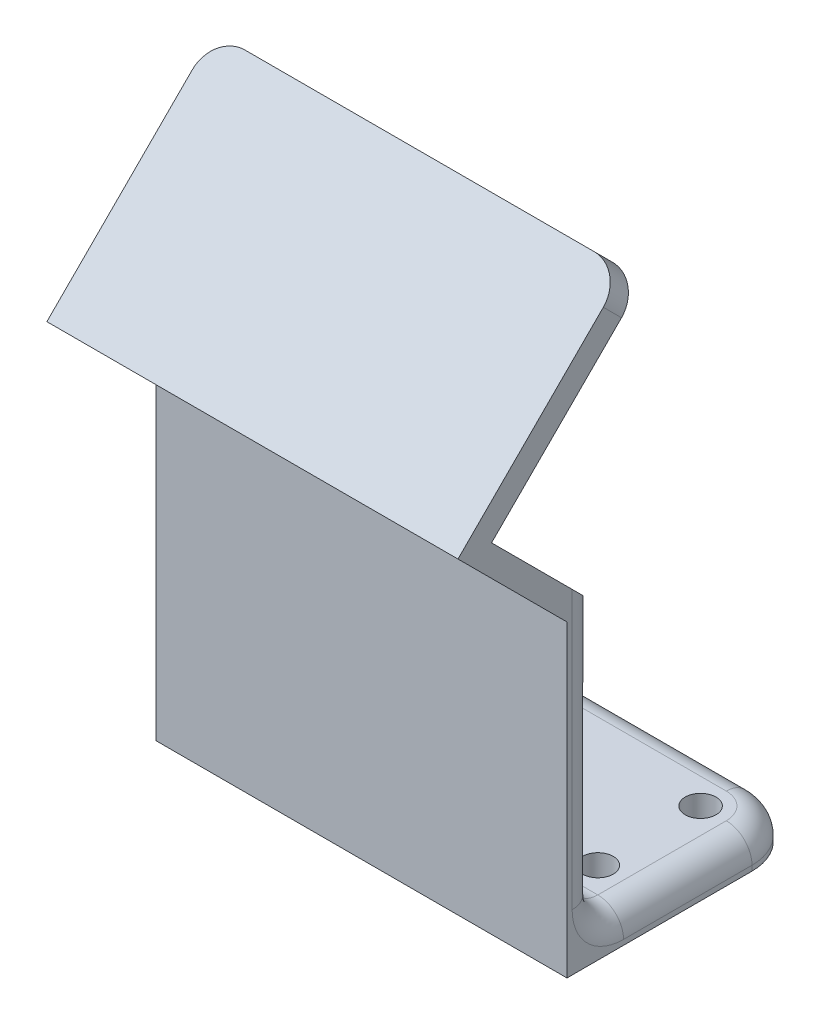
ISO-10303-21;
HEADER;
FILE_DESCRIPTION(('STEP AP214'),'2;1');
FILE_NAME('part.step','',(''),(''),'','','');
FILE_SCHEMA(('AUTOMOTIVE_DESIGN { 1 0 10303 214 1 1 1 1 }'));
ENDSEC;
DATA;
#1=APPLICATION_CONTEXT('core data for automotive mechanical design processes');
#2=APPLICATION_PROTOCOL_DEFINITION('international standard','automotive_design',2000,#1);
#3=PRODUCT_CONTEXT('',#1,'mechanical');
#4=PRODUCT('Part','Part','',(#3));
#5=PRODUCT_RELATED_PRODUCT_CATEGORY('part','',(#4));
#6=PRODUCT_DEFINITION_FORMATION('','',#4);
#7=PRODUCT_DEFINITION_CONTEXT('part definition',#1,'design');
#8=PRODUCT_DEFINITION('design','',#6,#7);
#9=PRODUCT_DEFINITION_SHAPE('','',#8);
#10=(LENGTH_UNIT() NAMED_UNIT(*) SI_UNIT(.MILLI.,.METRE.));
#11=(NAMED_UNIT(*) PLANE_ANGLE_UNIT() SI_UNIT($,.RADIAN.));
#12=(NAMED_UNIT(*) SI_UNIT($,.STERADIAN.) SOLID_ANGLE_UNIT());
#13=UNCERTAINTY_MEASURE_WITH_UNIT(LENGTH_MEASURE(1.E-05),#10,'distance_accuracy_value','');
#14=(GEOMETRIC_REPRESENTATION_CONTEXT(3) GLOBAL_UNCERTAINTY_ASSIGNED_CONTEXT((#13)) GLOBAL_UNIT_ASSIGNED_CONTEXT((#10,
#11,#12)) REPRESENTATION_CONTEXT('',''));
#15=CARTESIAN_POINT('',(0.,0.,0.));
#16=DIRECTION('',(0.,0.,1.));
#17=DIRECTION('',(1.,0.,0.));
#18=AXIS2_PLACEMENT_3D('',#15,#16,#17);
#19=CARTESIAN_POINT('',(-32.3593108702889,40.6066017177982,13.6066017177982));
#20=DIRECTION('',(0.,0.707106781186545,0.707106781186549));
#21=DIRECTION('',(0.,-0.70710678118655,0.707106781186546));
#22=AXIS2_PLACEMENT_3D('',#19,#20,#21);
#23=PLANE('',#22);
#24=CARTESIAN_POINT('',(3.,54.7487373415292,-0.53553390593266));
#25=DIRECTION('',(0.,0.707106781186546,0.707106781186549));
#26=DIRECTION('',(0.,-0.707106781186549,0.707106781186546));
#27=AXIS2_PLACEMENT_3D('',#24,#25,#26);
#28=CIRCLE('',#27,3.);
#29=CARTESIAN_POINT('',(0.,54.7487373415292,-0.53553390593265));
#30=VERTEX_POINT('',#29);
#31=CARTESIAN_POINT('',(3.00000000000002,56.8700576850888,-2.65685424949229));
#32=VERTEX_POINT('',#31);
#33=EDGE_CURVE('E183',#30,#32,#28,.F.);
#34=ORIENTED_EDGE('',*,*,#33,.F.);
#35=DIRECTION('',(0.,0.70710678118655,-0.707106781186546));
#36=VECTOR('',#35,1.);
#37=CARTESIAN_POINT('',(0.,40.6066017177982,13.6066017177982));
#38=LINE('',#37,#36);
#39=CARTESIAN_POINT('',(0.,40.6066017177982,13.6066017177982));
#40=VERTEX_POINT('',#39);
#41=EDGE_CURVE('E196',#40,#30,#38,.T.);
#42=ORIENTED_EDGE('',*,*,#41,.F.);
#43=DIRECTION('',(1.,0.,0.));
#44=VECTOR('',#43,1.);
#45=CARTESIAN_POINT('',(-32.3593108702889,40.6066017177982,13.6066017177982));
#46=LINE('',#45,#44);
#47=CARTESIAN_POINT('',(40.,40.6066017177982,13.6066017177982));
#48=VERTEX_POINT('',#47);
#49=EDGE_CURVE('E211',#40,#48,#46,.T.);
#50=ORIENTED_EDGE('',*,*,#49,.T.);
#51=DIRECTION('',(0.,-0.707106781186549,0.707106781186545));
#52=VECTOR('',#51,1.);
#53=CARTESIAN_POINT('',(40.,40.6066017177982,13.6066017177982));
#54=LINE('',#53,#52);
#55=CARTESIAN_POINT('',(40.,54.7487373415292,-0.535533905932639));
#56=VERTEX_POINT('',#55);
#57=EDGE_CURVE('E220',#56,#48,#54,.T.);
#58=ORIENTED_EDGE('',*,*,#57,.F.);
#59=CARTESIAN_POINT('',(37.,54.7487373415292,-0.535533905932653));
#60=DIRECTION('',(0.,0.707106781186546,0.707106781186549));
#61=DIRECTION('',(0.,-0.707106781186549,0.707106781186546));
#62=AXIS2_PLACEMENT_3D('',#59,#60,#61);
#63=CIRCLE('',#62,3.);
#64=CARTESIAN_POINT('',(37.,56.8700576850888,-2.65685424949229));
#65=VERTEX_POINT('',#64);
#66=EDGE_CURVE('E371',#56,#65,#63,.T.);
#67=ORIENTED_EDGE('',*,*,#66,.T.);
#68=DIRECTION('',(1.,0.,0.));
#69=VECTOR('',#68,1.);
#70=CARTESIAN_POINT('',(-32.3593108702889,56.8700576850888,-2.65685424949229));
#71=LINE('',#70,#69);
#72=EDGE_CURVE('E200',#32,#65,#71,.T.);
#73=ORIENTED_EDGE('',*,*,#72,.F.);
#74=EDGE_LOOP('',(#34,#42,#50,#58,#67,#73));
#75=FACE_BOUND('',#74,.T.);
#76=ADVANCED_FACE('F39',(#75),#23,.T.);
#77=CARTESIAN_POINT('',(-32.3593108702889,55.1022907321225,-4.42462120245867));
#78=DIRECTION('',(0.,-0.707106781186545,-0.70710678118655));
#79=DIRECTION('',(0.,0.70710678118655,-0.707106781186545));
#80=AXIS2_PLACEMENT_3D('',#77,#78,#79);
#81=PLANE('',#80);
#82=CARTESIAN_POINT('',(3.,52.9809703885628,-2.30330085889904));
#83=DIRECTION('',(0.,-0.707106781186545,-0.70710678118655));
#84=DIRECTION('',(0.,0.70710678118655,-0.707106781186545));
#85=AXIS2_PLACEMENT_3D('',#82,#83,#84);
#86=CIRCLE('',#85,3.);
#87=CARTESIAN_POINT('',(3.,55.1022907321225,-4.42462120245867));
#88=VERTEX_POINT('',#87);
#89=CARTESIAN_POINT('',(0.,52.9809703885628,-2.30330085889902));
#90=VERTEX_POINT('',#89);
#91=EDGE_CURVE('E186',#88,#90,#86,.F.);
#92=ORIENTED_EDGE('',*,*,#91,.F.);
#93=DIRECTION('',(1.,0.,0.));
#94=VECTOR('',#93,1.);
#95=CARTESIAN_POINT('',(-32.3593108702889,55.1022907321225,-4.42462120245867));
#96=LINE('',#95,#94);
#97=CARTESIAN_POINT('',(37.,55.1022907321225,-4.42462120245867));
#98=VERTEX_POINT('',#97);
#99=EDGE_CURVE('E228',#88,#98,#96,.T.);
#100=ORIENTED_EDGE('',*,*,#99,.T.);
#101=CARTESIAN_POINT('',(37.,52.9809703885628,-2.30330085889903));
#102=DIRECTION('',(0.,-0.707106781186545,-0.70710678118655));
#103=DIRECTION('',(0.,0.70710678118655,-0.707106781186545));
#104=AXIS2_PLACEMENT_3D('',#101,#102,#103);
#105=CIRCLE('',#104,3.);
#106=CARTESIAN_POINT('',(40.,52.9809703885628,-2.30330085889902));
#107=VERTEX_POINT('',#106);
#108=EDGE_CURVE('E291',#98,#107,#105,.T.);
#109=ORIENTED_EDGE('',*,*,#108,.T.);
#110=DIRECTION('',(0.,0.70710678118655,-0.707106781186545));
#111=VECTOR('',#110,1.);
#112=CARTESIAN_POINT('',(40.,55.1022907321225,-4.42462120245867));
#113=LINE('',#112,#111);
#114=CARTESIAN_POINT('',(40.,40.3388347648318,10.3388347648319));
#115=VERTEX_POINT('',#114);
#116=EDGE_CURVE('E217',#115,#107,#113,.T.);
#117=ORIENTED_EDGE('',*,*,#116,.F.);
#118=DIRECTION('',(1.,0.,0.));
#119=VECTOR('',#118,1.);
#120=CARTESIAN_POINT('',(-32.3593108702889,40.3388347648318,10.3388347648319));
#121=LINE('',#120,#119);
#122=CARTESIAN_POINT('',(0.,40.3388347648318,10.3388347648319));
#123=VERTEX_POINT('',#122);
#124=EDGE_CURVE('E225',#123,#115,#121,.T.);
#125=ORIENTED_EDGE('',*,*,#124,.F.);
#126=DIRECTION('',(0.,-0.70710678118655,0.707106781186545));
#127=VECTOR('',#126,1.);
#128=CARTESIAN_POINT('',(0.,55.1022907321225,-4.42462120245867));
#129=LINE('',#128,#127);
#130=EDGE_CURVE('E207',#90,#123,#129,.T.);
#131=ORIENTED_EDGE('',*,*,#130,.F.);
#132=EDGE_LOOP('',(#92,#100,#109,#117,#125,#131));
#133=FACE_BOUND('',#132,.T.);
#134=ADVANCED_FACE('F388',(#133),#81,.T.);
#135=CARTESIAN_POINT('',(5.,3.,-15.));
#136=DIRECTION('',(0.,-1.,0.));
#137=DIRECTION('',(0.,0.,-1.));
#138=AXIS2_PLACEMENT_3D('',#135,#136,#137);
#139=PLANE('',#138);
#140=CARTESIAN_POINT('',(35.,3.,-15.));
#141=DIRECTION('',(0.,-1.,0.));
#142=DIRECTION('',(0.,0.,-1.));
#143=AXIS2_PLACEMENT_3D('',#140,#141,#142);
#144=CIRCLE('',#143,2.5);
#145=CARTESIAN_POINT('',(37.5,3.,-15.));
#146=VERTEX_POINT('',#145);
#147=CARTESIAN_POINT('',(35.,3.,-17.5));
#148=VERTEX_POINT('',#147);
#149=EDGE_CURVE('E303',#146,#148,#144,.F.);
#150=ORIENTED_EDGE('',*,*,#149,.T.);
#151=DIRECTION('',(-1.,0.,0.));
#152=VECTOR('',#151,1.);
#153=CARTESIAN_POINT('',(5.,3.,-17.5));
#154=LINE('',#153,#152);
#155=CARTESIAN_POINT('',(5.00000000000004,3.,-17.5));
#156=VERTEX_POINT('',#155);
#157=EDGE_CURVE('E305',#148,#156,#154,.T.);
#158=ORIENTED_EDGE('',*,*,#157,.T.);
#159=CARTESIAN_POINT('',(5.,3.,-15.));
#160=DIRECTION('',(0.,-1.,0.));
#161=DIRECTION('',(0.,0.,-1.));
#162=AXIS2_PLACEMENT_3D('',#159,#160,#161);
#163=CIRCLE('',#162,2.5);
#164=CARTESIAN_POINT('',(2.5,3.,-15.));
#165=VERTEX_POINT('',#164);
#166=EDGE_CURVE('E301',#156,#165,#163,.F.);
#167=ORIENTED_EDGE('',*,*,#166,.T.);
#168=DIRECTION('',(0.,0.,1.));
#169=VECTOR('',#168,1.);
#170=CARTESIAN_POINT('',(2.5,3.,-15.));
#171=LINE('',#170,#169);
#172=CARTESIAN_POINT('',(2.5,3.,-2.5));
#173=VERTEX_POINT('',#172);
#174=EDGE_CURVE('E297',#165,#173,#171,.T.);
#175=ORIENTED_EDGE('',*,*,#174,.T.);
#176=DIRECTION('',(1.,0.,0.));
#177=VECTOR('',#176,1.);
#178=CARTESIAN_POINT('',(5.,3.,-2.5));
#179=LINE('',#178,#177);
#180=CARTESIAN_POINT('',(37.5,3.,-2.5));
#181=VERTEX_POINT('',#180);
#182=EDGE_CURVE('E295',#173,#181,#179,.T.);
#183=ORIENTED_EDGE('',*,*,#182,.T.);
#184=DIRECTION('',(0.,0.,-1.));
#185=VECTOR('',#184,1.);
#186=CARTESIAN_POINT('',(37.5,3.,-15.));
#187=LINE('',#186,#185);
#188=EDGE_CURVE('E299',#181,#146,#187,.T.);
#189=ORIENTED_EDGE('',*,*,#188,.T.);
#190=EDGE_LOOP('',(#150,#158,#167,#175,#183,#189));
#191=FACE_BOUND('',#190,.T.);
#192=CARTESIAN_POINT('',(5.,3.,-15.));
#193=DIRECTION('',(0.,1.,0.));
#194=DIRECTION('',(0.,0.,1.));
#195=AXIS2_PLACEMENT_3D('',#192,#193,#194);
#196=CIRCLE('',#195,1.5);
#197=CARTESIAN_POINT('',(5.,3.,-13.5));
#198=VERTEX_POINT('',#197);
#199=EDGE_CURVE('E264',#198,#198,#196,.T.);
#200=ORIENTED_EDGE('',*,*,#199,.F.);
#201=EDGE_LOOP('',(#200));
#202=FACE_BOUND('',#201,.T.);
#203=CARTESIAN_POINT('',(5.,3.,-5.));
#204=DIRECTION('',(0.,1.,0.));
#205=DIRECTION('',(0.,0.,1.));
#206=AXIS2_PLACEMENT_3D('',#203,#204,#205);
#207=CIRCLE('',#206,1.5);
#208=CARTESIAN_POINT('',(5.,3.,-3.5));
#209=VERTEX_POINT('',#208);
#210=EDGE_CURVE('E258',#209,#209,#207,.T.);
#211=ORIENTED_EDGE('',*,*,#210,.F.);
#212=EDGE_LOOP('',(#211));
#213=FACE_BOUND('',#212,.T.);
#214=CARTESIAN_POINT('',(35.,3.,-15.));
#215=DIRECTION('',(0.,1.,0.));
#216=DIRECTION('',(0.,0.,-1.));
#217=AXIS2_PLACEMENT_3D('',#214,#215,#216);
#218=CIRCLE('',#217,1.5);
#219=CARTESIAN_POINT('',(35.,3.,-16.5));
#220=VERTEX_POINT('',#219);
#221=EDGE_CURVE('E252',#220,#220,#218,.T.);
#222=ORIENTED_EDGE('',*,*,#221,.F.);
#223=EDGE_LOOP('',(#222));
#224=FACE_BOUND('',#223,.T.);
#225=CARTESIAN_POINT('',(35.,3.,-5.));
#226=DIRECTION('',(0.,1.,0.));
#227=DIRECTION('',(0.,0.,-1.));
#228=AXIS2_PLACEMENT_3D('',#225,#226,#227);
#229=CIRCLE('',#228,1.5);
#230=CARTESIAN_POINT('',(35.,3.,-6.5));
#231=VERTEX_POINT('',#230);
#232=EDGE_CURVE('E246',#231,#231,#229,.T.);
#233=ORIENTED_EDGE('',*,*,#232,.F.);
#234=EDGE_LOOP('',(#233));
#235=FACE_BOUND('',#234,.T.);
#236=ADVANCED_FACE('F463',(#191,#202,#213,#224,#235),#139,.F.);
#237=CARTESIAN_POINT('',(5.,0.,-15.));
#238=DIRECTION('',(0.,-1.,0.));
#239=DIRECTION('',(0.,0.,-1.));
#240=AXIS2_PLACEMENT_3D('',#237,#238,#239);
#241=PLANE('',#240);
#242=CARTESIAN_POINT('',(35.,0.,-15.));
#243=DIRECTION('',(0.,1.,0.));
#244=DIRECTION('',(0.,0.,-1.));
#245=AXIS2_PLACEMENT_3D('',#242,#243,#244);
#246=CIRCLE('',#245,1.5);
#247=CARTESIAN_POINT('',(35.,0.,-16.5));
#248=VERTEX_POINT('',#247);
#249=EDGE_CURVE('E249',#248,#248,#246,.T.);
#250=ORIENTED_EDGE('',*,*,#249,.T.);
#251=EDGE_LOOP('',(#250));
#252=FACE_BOUND('',#251,.T.);
#253=CARTESIAN_POINT('',(5.,0.,-15.));
#254=DIRECTION('',(0.,1.,0.));
#255=DIRECTION('',(0.,0.,1.));
#256=AXIS2_PLACEMENT_3D('',#253,#254,#255);
#257=CIRCLE('',#256,1.5);
#258=CARTESIAN_POINT('',(5.,0.,-13.5));
#259=VERTEX_POINT('',#258);
#260=EDGE_CURVE('E261',#259,#259,#257,.T.);
#261=ORIENTED_EDGE('',*,*,#260,.T.);
#262=EDGE_LOOP('',(#261));
#263=FACE_BOUND('',#262,.T.);
#264=DIRECTION('',(0.,0.,1.));
#265=VECTOR('',#264,1.);
#266=CARTESIAN_POINT('',(0.,0.,0.));
#267=LINE('',#266,#265);
#268=CARTESIAN_POINT('',(0.,0.,-15.));
#269=VERTEX_POINT('',#268);
#270=CARTESIAN_POINT('',(0.,0.,3.));
#271=VERTEX_POINT('',#270);
#272=EDGE_CURVE('E267',#269,#271,#267,.T.);
#273=ORIENTED_EDGE('',*,*,#272,.F.);
#274=CARTESIAN_POINT('',(5.,0.,-15.));
#275=DIRECTION('',(0.,1.,0.));
#276=DIRECTION('',(0.,0.,-1.));
#277=AXIS2_PLACEMENT_3D('',#274,#275,#276);
#278=CIRCLE('',#277,5.);
#279=CARTESIAN_POINT('',(5.00000000000004,0.,-20.));
#280=VERTEX_POINT('',#279);
#281=EDGE_CURVE('E280',#280,#269,#278,.T.);
#282=ORIENTED_EDGE('',*,*,#281,.F.);
#283=DIRECTION('',(-1.,0.,0.));
#284=VECTOR('',#283,1.);
#285=CARTESIAN_POINT('',(5.00000000000004,0.,-20.));
#286=LINE('',#285,#284);
#287=CARTESIAN_POINT('',(35.,0.,-20.));
#288=VERTEX_POINT('',#287);
#289=EDGE_CURVE('E277',#288,#280,#286,.T.);
#290=ORIENTED_EDGE('',*,*,#289,.F.);
#291=CARTESIAN_POINT('',(35.,0.,-15.));
#292=DIRECTION('',(0.,1.,0.));
#293=DIRECTION('',(0.,0.,1.));
#294=AXIS2_PLACEMENT_3D('',#291,#292,#293);
#295=CIRCLE('',#294,5.);
#296=CARTESIAN_POINT('',(40.,0.,-15.));
#297=VERTEX_POINT('',#296);
#298=EDGE_CURVE('E274',#297,#288,#295,.T.);
#299=ORIENTED_EDGE('',*,*,#298,.F.);
#300=DIRECTION('',(0.,0.,-1.));
#301=VECTOR('',#300,1.);
#302=CARTESIAN_POINT('',(40.,0.,0.));
#303=LINE('',#302,#301);
#304=CARTESIAN_POINT('',(40.,0.,3.));
#305=VERTEX_POINT('',#304);
#306=EDGE_CURVE('E271',#305,#297,#303,.T.);
#307=ORIENTED_EDGE('',*,*,#306,.F.);
#308=DIRECTION('',(1.,0.,0.));
#309=VECTOR('',#308,1.);
#310=CARTESIAN_POINT('',(0.,0.,3.));
#311=LINE('',#310,#309);
#312=EDGE_CURVE('E238',#271,#305,#311,.T.);
#313=ORIENTED_EDGE('',*,*,#312,.F.);
#314=EDGE_LOOP('',(#273,#282,#290,#299,#307,#313));
#315=FACE_BOUND('',#314,.T.);
#316=CARTESIAN_POINT('',(5.,0.,-5.));
#317=DIRECTION('',(0.,1.,0.));
#318=DIRECTION('',(0.,0.,1.));
#319=AXIS2_PLACEMENT_3D('',#316,#317,#318);
#320=CIRCLE('',#319,1.5);
#321=CARTESIAN_POINT('',(5.,0.,-3.5));
#322=VERTEX_POINT('',#321);
#323=EDGE_CURVE('E255',#322,#322,#320,.T.);
#324=ORIENTED_EDGE('',*,*,#323,.T.);
#325=EDGE_LOOP('',(#324));
#326=FACE_BOUND('',#325,.T.);
#327=CARTESIAN_POINT('',(35.,0.,-5.));
#328=DIRECTION('',(0.,1.,0.));
#329=DIRECTION('',(0.,0.,-1.));
#330=AXIS2_PLACEMENT_3D('',#327,#328,#329);
#331=CIRCLE('',#330,1.5);
#332=CARTESIAN_POINT('',(35.,0.,-6.5));
#333=VERTEX_POINT('',#332);
#334=EDGE_CURVE('E245',#333,#333,#331,.T.);
#335=ORIENTED_EDGE('',*,*,#334,.T.);
#336=EDGE_LOOP('',(#335));
#337=FACE_BOUND('',#336,.T.);
#338=ADVANCED_FACE('F431',(#252,#263,#315,#326,#337),#241,.T.);
#339=CARTESIAN_POINT('',(0.,3.,0.));
#340=DIRECTION('',(1.,0.,0.));
#341=DIRECTION('',(0.,0.,-1.));
#342=AXIS2_PLACEMENT_3D('',#339,#340,#341);
#343=PLANE('',#342);
#344=CARTESIAN_POINT('',(0.,5.5,-2.5));
#345=DIRECTION('',(1.,0.,0.));
#346=DIRECTION('',(0.,0.,-1.));
#347=AXIS2_PLACEMENT_3D('',#344,#345,#346);
#348=CIRCLE('',#347,5.);
#349=CARTESIAN_POINT('',(0.,0.5,-2.5));
#350=VERTEX_POINT('',#349);
#351=CARTESIAN_POINT('',(0.,5.5,2.5));
#352=VERTEX_POINT('',#351);
#353=EDGE_CURVE('E322',#350,#352,#348,.F.);
#354=ORIENTED_EDGE('',*,*,#353,.F.);
#355=DIRECTION('',(0.,0.,1.));
#356=VECTOR('',#355,1.);
#357=CARTESIAN_POINT('',(0.,0.5,0.));
#358=LINE('',#357,#356);
#359=CARTESIAN_POINT('',(0.,0.5,-15.));
#360=VERTEX_POINT('',#359);
#361=EDGE_CURVE('E327',#350,#360,#358,.F.);
#362=ORIENTED_EDGE('',*,*,#361,.T.);
#363=DIRECTION('',(0.,-1.,0.));
#364=VECTOR('',#363,1.);
#365=CARTESIAN_POINT('',(0.,3.,-15.));
#366=LINE('',#365,#364);
#367=EDGE_CURVE('E283',#360,#269,#366,.T.);
#368=ORIENTED_EDGE('',*,*,#367,.T.);
#369=ORIENTED_EDGE('',*,*,#272,.T.);
#370=DIRECTION('',(0.,-1.,0.));
#371=VECTOR('',#370,1.);
#372=CARTESIAN_POINT('',(0.,0.,3.));
#373=LINE('',#372,#371);
#374=CARTESIAN_POINT('',(0.,30.,3.));
#375=VERTEX_POINT('',#374);
#376=EDGE_CURVE('E235',#375,#271,#373,.T.);
#377=ORIENTED_EDGE('',*,*,#376,.F.);
#378=DIRECTION('',(0.,0.707106781186545,0.70710678118655));
#379=VECTOR('',#378,1.);
#380=CARTESIAN_POINT('',(0.,30.,3.));
#381=LINE('',#380,#379);
#382=EDGE_CURVE('E206',#375,#40,#381,.T.);
#383=ORIENTED_EDGE('',*,*,#382,.T.);
#384=ORIENTED_EDGE('',*,*,#41,.T.);
#385=DIRECTION('',(0.,0.707106781186546,0.707106781186549));
#386=VECTOR('',#385,1.);
#387=CARTESIAN_POINT('',(0.,52.6274169979695,-2.6568542494923));
#388=LINE('',#387,#386);
#389=EDGE_CURVE('E180',#90,#30,#388,.T.);
#390=ORIENTED_EDGE('',*,*,#389,.F.);
#391=ORIENTED_EDGE('',*,*,#130,.T.);
#392=DIRECTION('',(0.,-0.707106781186545,-0.70710678118655));
#393=VECTOR('',#392,1.);
#394=CARTESIAN_POINT('',(0.,40.3388347648318,10.3388347648319));
#395=LINE('',#394,#393);
#396=CARTESIAN_POINT('',(0.,32.5,2.5));
#397=VERTEX_POINT('',#396);
#398=EDGE_CURVE('E209',#123,#397,#395,.T.);
#399=ORIENTED_EDGE('',*,*,#398,.T.);
#400=DIRECTION('',(0.,-1.,0.));
#401=VECTOR('',#400,1.);
#402=CARTESIAN_POINT('',(0.,3.,2.5));
#403=LINE('',#402,#401);
#404=EDGE_CURVE('E325',#397,#352,#403,.T.);
#405=ORIENTED_EDGE('',*,*,#404,.T.);
#406=EDGE_LOOP('',(#354,#362,#368,#369,#377,#383,#384,#390,#391,#399,#405));
#407=FACE_BOUND('',#406,.T.);
#408=ADVANCED_FACE('F203',(#407),#343,.F.);
#409=CARTESIAN_POINT('',(40.,3.,0.));
#410=DIRECTION('',(-1.,0.,0.));
#411=DIRECTION('',(0.,0.,1.));
#412=AXIS2_PLACEMENT_3D('',#409,#410,#411);
#413=PLANE('',#412);
#414=DIRECTION('',(0.,-1.,0.));
#415=VECTOR('',#414,1.);
#416=CARTESIAN_POINT('',(40.,3.,-15.));
#417=LINE('',#416,#415);
#418=CARTESIAN_POINT('',(40.,0.5,-15.));
#419=VERTEX_POINT('',#418);
#420=EDGE_CURVE('E289',#419,#297,#417,.T.);
#421=ORIENTED_EDGE('',*,*,#420,.F.);
#422=DIRECTION('',(0.,0.,-1.));
#423=VECTOR('',#422,1.);
#424=CARTESIAN_POINT('',(40.,0.5,0.));
#425=LINE('',#424,#423);
#426=CARTESIAN_POINT('',(40.,0.5,-2.5));
#427=VERTEX_POINT('',#426);
#428=EDGE_CURVE('E320',#419,#427,#425,.F.);
#429=ORIENTED_EDGE('',*,*,#428,.T.);
#430=CARTESIAN_POINT('',(40.,5.5,-2.5));
#431=DIRECTION('',(-1.,0.,0.));
#432=DIRECTION('',(0.,0.,1.));
#433=AXIS2_PLACEMENT_3D('',#430,#431,#432);
#434=CIRCLE('',#433,5.);
#435=CARTESIAN_POINT('',(40.,5.5,2.5));
#436=VERTEX_POINT('',#435);
#437=EDGE_CURVE('E317',#436,#427,#434,.F.);
#438=ORIENTED_EDGE('',*,*,#437,.F.);
#439=DIRECTION('',(0.,1.,0.));
#440=VECTOR('',#439,1.);
#441=CARTESIAN_POINT('',(40.,30.,2.5));
#442=LINE('',#441,#440);
#443=CARTESIAN_POINT('',(40.,32.5,2.5));
#444=VERTEX_POINT('',#443);
#445=EDGE_CURVE('E315',#436,#444,#442,.T.);
#446=ORIENTED_EDGE('',*,*,#445,.T.);
#447=DIRECTION('',(0.,0.707106781186545,0.70710678118655));
#448=VECTOR('',#447,1.);
#449=CARTESIAN_POINT('',(40.,40.3388347648318,10.3388347648319));
#450=LINE('',#449,#448);
#451=EDGE_CURVE('E215',#444,#115,#450,.T.);
#452=ORIENTED_EDGE('',*,*,#451,.T.);
#453=ORIENTED_EDGE('',*,*,#116,.T.);
#454=DIRECTION('',(0.,0.707106781186546,0.707106781186549));
#455=VECTOR('',#454,1.);
#456=CARTESIAN_POINT('',(40.,52.6274169979695,-2.65685424949229));
#457=LINE('',#456,#455);
#458=EDGE_CURVE('E375',#107,#56,#457,.T.);
#459=ORIENTED_EDGE('',*,*,#458,.T.);
#460=ORIENTED_EDGE('',*,*,#57,.T.);
#461=DIRECTION('',(0.,-0.707106781186545,-0.70710678118655));
#462=VECTOR('',#461,1.);
#463=CARTESIAN_POINT('',(40.,30.,3.));
#464=LINE('',#463,#462);
#465=CARTESIAN_POINT('',(40.,30.,3.));
#466=VERTEX_POINT('',#465);
#467=EDGE_CURVE('E222',#48,#466,#464,.T.);
#468=ORIENTED_EDGE('',*,*,#467,.T.);
#469=DIRECTION('',(0.,1.,0.));
#470=VECTOR('',#469,1.);
#471=CARTESIAN_POINT('',(40.,0.,3.));
#472=LINE('',#471,#470);
#473=EDGE_CURVE('E241',#305,#466,#472,.T.);
#474=ORIENTED_EDGE('',*,*,#473,.F.);
#475=ORIENTED_EDGE('',*,*,#306,.T.);
#476=EDGE_LOOP('',(#421,#429,#438,#446,#452,#453,#459,#460,#468,#474,#475));
#477=FACE_BOUND('',#476,.T.);
#478=ADVANCED_FACE('F440',(#477),#413,.F.);
#479=CARTESIAN_POINT('',(35.,3.,-15.));
#480=DIRECTION('',(0.,-1.,0.));
#481=DIRECTION('',(0.,0.,-1.));
#482=AXIS2_PLACEMENT_3D('',#479,#480,#481);
#483=CYLINDRICAL_SURFACE('',#482,5.);
#484=DIRECTION('',(0.,-1.,0.));
#485=VECTOR('',#484,1.);
#486=CARTESIAN_POINT('',(35.,3.,-20.));
#487=LINE('',#486,#485);
#488=CARTESIAN_POINT('',(35.,0.5,-20.));
#489=VERTEX_POINT('',#488);
#490=EDGE_CURVE('E287',#489,#288,#487,.T.);
#491=ORIENTED_EDGE('',*,*,#490,.F.);
#492=CARTESIAN_POINT('',(35.,0.5,-15.));
#493=DIRECTION('',(0.,-1.,0.));
#494=DIRECTION('',(0.,0.,-1.));
#495=AXIS2_PLACEMENT_3D('',#492,#493,#494);
#496=CIRCLE('',#495,5.);
#497=EDGE_CURVE('E311',#489,#419,#496,.T.);
#498=ORIENTED_EDGE('',*,*,#497,.T.);
#499=ORIENTED_EDGE('',*,*,#420,.T.);
#500=ORIENTED_EDGE('',*,*,#298,.T.);
#501=EDGE_LOOP('',(#491,#498,#499,#500));
#502=FACE_BOUND('',#501,.T.);
#503=ADVANCED_FACE('F426',(#502),#483,.T.);
#504=CARTESIAN_POINT('',(5.00000000000004,3.,-20.));
#505=DIRECTION('',(0.,0.,1.));
#506=DIRECTION('',(1.,0.,0.));
#507=AXIS2_PLACEMENT_3D('',#504,#505,#506);
#508=PLANE('',#507);
#509=DIRECTION('',(0.,-1.,0.));
#510=VECTOR('',#509,1.);
#511=CARTESIAN_POINT('',(5.00000000000004,3.,-20.));
#512=LINE('',#511,#510);
#513=CARTESIAN_POINT('',(5.00000000000004,0.5,-20.));
#514=VERTEX_POINT('',#513);
#515=EDGE_CURVE('E285',#514,#280,#512,.T.);
#516=ORIENTED_EDGE('',*,*,#515,.F.);
#517=DIRECTION('',(-1.,0.,0.));
#518=VECTOR('',#517,1.);
#519=CARTESIAN_POINT('',(5.00000000000004,0.5,-20.));
#520=LINE('',#519,#518);
#521=EDGE_CURVE('E308',#514,#489,#520,.F.);
#522=ORIENTED_EDGE('',*,*,#521,.T.);
#523=ORIENTED_EDGE('',*,*,#490,.T.);
#524=ORIENTED_EDGE('',*,*,#289,.T.);
#525=EDGE_LOOP('',(#516,#522,#523,#524));
#526=FACE_BOUND('',#525,.T.);
#527=ADVANCED_FACE('F424',(#526),#508,.F.);
#528=CARTESIAN_POINT('',(5.,3.,-15.));
#529=DIRECTION('',(0.,-1.,0.));
#530=DIRECTION('',(0.,0.,-1.));
#531=AXIS2_PLACEMENT_3D('',#528,#529,#530);
#532=CYLINDRICAL_SURFACE('',#531,5.);
#533=ORIENTED_EDGE('',*,*,#367,.F.);
#534=CARTESIAN_POINT('',(5.,0.5,-15.));
#535=DIRECTION('',(0.,-1.,0.));
#536=DIRECTION('',(0.,0.,-1.));
#537=AXIS2_PLACEMENT_3D('',#534,#535,#536);
#538=CIRCLE('',#537,5.);
#539=EDGE_CURVE('E313',#360,#514,#538,.T.);
#540=ORIENTED_EDGE('',*,*,#539,.T.);
#541=ORIENTED_EDGE('',*,*,#515,.T.);
#542=ORIENTED_EDGE('',*,*,#281,.T.);
#543=EDGE_LOOP('',(#533,#540,#541,#542));
#544=FACE_BOUND('',#543,.T.);
#545=ADVANCED_FACE('F405',(#544),#532,.T.);
#546=CARTESIAN_POINT('',(5.,3.,-15.));
#547=DIRECTION('',(0.,-1.,0.));
#548=DIRECTION('',(0.,0.,-1.));
#549=AXIS2_PLACEMENT_3D('',#546,#547,#548);
#550=CYLINDRICAL_SURFACE('',#549,1.5);
#551=ORIENTED_EDGE('',*,*,#199,.T.);
#552=EDGE_LOOP('',(#551));
#553=FACE_BOUND('',#552,.T.);
#554=ORIENTED_EDGE('',*,*,#260,.F.);
#555=EDGE_LOOP('',(#554));
#556=FACE_BOUND('',#555,.T.);
#557=ADVANCED_FACE('F581',(#553,#556),#550,.F.);
#558=CARTESIAN_POINT('',(5.,3.,-5.));
#559=DIRECTION('',(0.,-1.,0.));
#560=DIRECTION('',(0.,0.,-1.));
#561=AXIS2_PLACEMENT_3D('',#558,#559,#560);
#562=CYLINDRICAL_SURFACE('',#561,1.5);
#563=ORIENTED_EDGE('',*,*,#210,.T.);
#564=EDGE_LOOP('',(#563));
#565=FACE_BOUND('',#564,.T.);
#566=ORIENTED_EDGE('',*,*,#323,.F.);
#567=EDGE_LOOP('',(#566));
#568=FACE_BOUND('',#567,.T.);
#569=ADVANCED_FACE('F588',(#565,#568),#562,.F.);
#570=CARTESIAN_POINT('',(35.,3.,-15.));
#571=DIRECTION('',(0.,-1.,0.));
#572=DIRECTION('',(0.,0.,-1.));
#573=AXIS2_PLACEMENT_3D('',#570,#571,#572);
#574=CYLINDRICAL_SURFACE('',#573,1.5);
#575=ORIENTED_EDGE('',*,*,#221,.T.);
#576=EDGE_LOOP('',(#575));
#577=FACE_BOUND('',#576,.T.);
#578=ORIENTED_EDGE('',*,*,#249,.F.);
#579=EDGE_LOOP('',(#578));
#580=FACE_BOUND('',#579,.T.);
#581=ADVANCED_FACE('F592',(#577,#580),#574,.F.);
#582=CARTESIAN_POINT('',(35.,3.,-5.));
#583=DIRECTION('',(0.,-1.,0.));
#584=DIRECTION('',(0.,0.,-1.));
#585=AXIS2_PLACEMENT_3D('',#582,#583,#584);
#586=CYLINDRICAL_SURFACE('',#585,1.5);
#587=ORIENTED_EDGE('',*,*,#232,.T.);
#588=EDGE_LOOP('',(#587));
#589=FACE_BOUND('',#588,.T.);
#590=ORIENTED_EDGE('',*,*,#334,.F.);
#591=EDGE_LOOP('',(#590));
#592=FACE_BOUND('',#591,.T.);
#593=ADVANCED_FACE('F596',(#589,#592),#586,.F.);
#594=CARTESIAN_POINT('',(0.,0.,0.));
#595=DIRECTION('',(0.,0.,-1.));
#596=DIRECTION('',(-1.,0.,0.));
#597=AXIS2_PLACEMENT_3D('',#594,#595,#596);
#598=PLANE('',#597);
#599=DIRECTION('',(-1.,0.,0.));
#600=VECTOR('',#599,1.);
#601=CARTESIAN_POINT('',(0.,28.9644660940673,0.));
#602=LINE('',#601,#600);
#603=CARTESIAN_POINT('',(2.5,28.9644660940673,0.));
#604=VERTEX_POINT('',#603);
#605=CARTESIAN_POINT('',(37.5,28.9644660940673,0.));
#606=VERTEX_POINT('',#605);
#607=EDGE_CURVE('E48',#604,#606,#602,.F.);
#608=ORIENTED_EDGE('',*,*,#607,.T.);
#609=DIRECTION('',(0.,1.,0.));
#610=VECTOR('',#609,1.);
#611=CARTESIAN_POINT('',(37.5,3.,0.));
#612=LINE('',#611,#610);
#613=CARTESIAN_POINT('',(37.5,5.5,0.));
#614=VERTEX_POINT('',#613);
#615=EDGE_CURVE('E11',#606,#614,#612,.F.);
#616=ORIENTED_EDGE('',*,*,#615,.T.);
#617=DIRECTION('',(1.,0.,0.));
#618=VECTOR('',#617,1.);
#619=CARTESIAN_POINT('',(0.,5.5,0.));
#620=LINE('',#619,#618);
#621=CARTESIAN_POINT('',(2.5,5.5,0.));
#622=VERTEX_POINT('',#621);
#623=EDGE_CURVE('E335',#614,#622,#620,.F.);
#624=ORIENTED_EDGE('',*,*,#623,.T.);
#625=DIRECTION('',(0.,-1.,0.));
#626=VECTOR('',#625,1.);
#627=CARTESIAN_POINT('',(2.5,30.,0.));
#628=LINE('',#627,#626);
#629=EDGE_CURVE('E59',#622,#604,#628,.F.);
#630=ORIENTED_EDGE('',*,*,#629,.T.);
#631=EDGE_LOOP('',(#608,#616,#624,#630));
#632=FACE_BOUND('',#631,.T.);
#633=ADVANCED_FACE('F480',(#632),#598,.T.);
#634=CARTESIAN_POINT('',(0.,0.,3.));
#635=DIRECTION('',(0.,0.,-1.));
#636=DIRECTION('',(-1.,0.,0.));
#637=AXIS2_PLACEMENT_3D('',#634,#635,#636);
#638=PLANE('',#637);
#639=ORIENTED_EDGE('',*,*,#376,.T.);
#640=ORIENTED_EDGE('',*,*,#312,.T.);
#641=ORIENTED_EDGE('',*,*,#473,.T.);
#642=DIRECTION('',(-1.,0.,0.));
#643=VECTOR('',#642,1.);
#644=CARTESIAN_POINT('',(0.,30.,3.));
#645=LINE('',#644,#643);
#646=EDGE_CURVE('E243',#466,#375,#645,.T.);
#647=ORIENTED_EDGE('',*,*,#646,.T.);
#648=EDGE_LOOP('',(#639,#640,#641,#647));
#649=FACE_BOUND('',#648,.T.);
#650=ADVANCED_FACE('F465',(#649),#638,.F.);
#651=CARTESIAN_POINT('',(-32.3593108702889,30.,3.));
#652=DIRECTION('',(0.,-0.70710678118655,0.707106781186545));
#653=DIRECTION('',(0.,-0.707106781186545,-0.70710678118655));
#654=AXIS2_PLACEMENT_3D('',#651,#652,#653);
#655=PLANE('',#654);
#656=ORIENTED_EDGE('',*,*,#382,.F.);
#657=ORIENTED_EDGE('',*,*,#646,.F.);
#658=ORIENTED_EDGE('',*,*,#467,.F.);
#659=ORIENTED_EDGE('',*,*,#49,.F.);
#660=EDGE_LOOP('',(#656,#657,#658,#659));
#661=FACE_BOUND('',#660,.T.);
#662=ADVANCED_FACE('F437',(#661),#655,.T.);
#663=CARTESIAN_POINT('',(-32.3593108702889,56.8700576850888,-2.65685424949229));
#664=DIRECTION('',(0.,0.70710678118655,-0.707106781186545));
#665=DIRECTION('',(0.,0.707106781186545,0.70710678118655));
#666=AXIS2_PLACEMENT_3D('',#663,#664,#665);
#667=PLANE('',#666);
#668=DIRECTION('',(0.,0.707106781186546,0.707106781186549));
#669=VECTOR('',#668,1.);
#670=CARTESIAN_POINT('',(3.00000000000002,54.7487373415292,-4.77817459305194));
#671=LINE('',#670,#669);
#672=EDGE_CURVE('E190',#88,#32,#671,.T.);
#673=ORIENTED_EDGE('',*,*,#672,.T.);
#674=ORIENTED_EDGE('',*,*,#72,.T.);
#675=DIRECTION('',(0.,0.707106781186546,0.707106781186549));
#676=VECTOR('',#675,1.);
#677=CARTESIAN_POINT('',(37.,54.7487373415292,-4.77817459305194));
#678=LINE('',#677,#676);
#679=EDGE_CURVE('E201',#98,#65,#678,.T.);
#680=ORIENTED_EDGE('',*,*,#679,.F.);
#681=ORIENTED_EDGE('',*,*,#99,.F.);
#682=EDGE_LOOP('',(#673,#674,#680,#681));
#683=FACE_BOUND('',#682,.T.);
#684=ADVANCED_FACE('F386',(#683),#667,.T.);
#685=CARTESIAN_POINT('',(-32.3593108702889,40.3388347648318,10.3388347648319));
#686=DIRECTION('',(0.,0.70710678118655,-0.707106781186545));
#687=DIRECTION('',(0.,0.707106781186545,0.70710678118655));
#688=AXIS2_PLACEMENT_3D('',#685,#686,#687);
#689=PLANE('',#688);
#690=ORIENTED_EDGE('',*,*,#451,.F.);
#691=CARTESIAN_POINT('',(37.5,32.5,2.5));
#692=DIRECTION('',(0.,0.70710678118655,-0.707106781186545));
#693=DIRECTION('',(0.,-0.707106781186545,-0.70710678118655));
#694=AXIS2_PLACEMENT_3D('',#691,#692,#693);
#695=ELLIPSE('',#694,3.53553390593273,2.5);
#696=CARTESIAN_POINT('',(39.2677669529664,30.7322330470336,0.732233047033636));
#697=VERTEX_POINT('',#696);
#698=EDGE_CURVE('E333',#444,#697,#695,.T.);
#699=ORIENTED_EDGE('',*,*,#698,.T.);
#700=DIRECTION('',(-1.,0.,0.));
#701=VECTOR('',#700,1.);
#702=CARTESIAN_POINT('',(-32.3593108702889,30.7322330470336,0.732233047033636));
#703=LINE('',#702,#701);
#704=CARTESIAN_POINT('',(0.732233047033626,30.7322330470336,0.732233047033636));
#705=VERTEX_POINT('',#704);
#706=EDGE_CURVE('E331',#697,#705,#703,.T.);
#707=ORIENTED_EDGE('',*,*,#706,.T.);
#708=CARTESIAN_POINT('',(2.5,32.5,2.5));
#709=DIRECTION('',(0.,0.70710678118655,-0.707106781186545));
#710=DIRECTION('',(0.,0.707106781186545,0.70710678118655));
#711=AXIS2_PLACEMENT_3D('',#708,#709,#710);
#712=ELLIPSE('',#711,3.53553390593273,2.5);
#713=EDGE_CURVE('E329',#705,#397,#712,.T.);
#714=ORIENTED_EDGE('',*,*,#713,.T.);
#715=ORIENTED_EDGE('',*,*,#398,.F.);
#716=ORIENTED_EDGE('',*,*,#124,.T.);
#717=EDGE_LOOP('',(#690,#699,#707,#714,#715,#716));
#718=FACE_BOUND('',#717,.T.);
#719=ADVANCED_FACE('F444',(#718),#689,.T.);
#720=CARTESIAN_POINT('',(37.,52.6274169979695,-2.6568542494923));
#721=DIRECTION('',(0.,0.707106781186546,0.707106781186549));
#722=DIRECTION('',(0.,-0.707106781186549,0.707106781186546));
#723=AXIS2_PLACEMENT_3D('',#720,#721,#722);
#724=CYLINDRICAL_SURFACE('',#723,3.);
#725=ORIENTED_EDGE('',*,*,#679,.T.);
#726=ORIENTED_EDGE('',*,*,#66,.F.);
#727=ORIENTED_EDGE('',*,*,#458,.F.);
#728=ORIENTED_EDGE('',*,*,#108,.F.);
#729=EDGE_LOOP('',(#725,#726,#727,#728));
#730=FACE_BOUND('',#729,.T.);
#731=ADVANCED_FACE('F383',(#730),#724,.T.);
#732=CARTESIAN_POINT('',(3.,52.6274169979695,-2.65685424949231));
#733=DIRECTION('',(0.,0.707106781186546,0.707106781186549));
#734=DIRECTION('',(0.,-0.707106781186549,0.707106781186546));
#735=AXIS2_PLACEMENT_3D('',#732,#733,#734);
#736=CYLINDRICAL_SURFACE('',#735,3.);
#737=ORIENTED_EDGE('',*,*,#91,.T.);
#738=ORIENTED_EDGE('',*,*,#389,.T.);
#739=ORIENTED_EDGE('',*,*,#33,.T.);
#740=ORIENTED_EDGE('',*,*,#672,.F.);
#741=EDGE_LOOP('',(#737,#738,#739,#740));
#742=FACE_BOUND('',#741,.T.);
#743=ADVANCED_FACE('F182',(#742),#736,.T.);
#744=CARTESIAN_POINT('',(-32.3593108702889,28.9644660940673,2.5));
#745=DIRECTION('',(-1.,0.,0.));
#746=DIRECTION('',(0.,0.,1.));
#747=AXIS2_PLACEMENT_3D('',#744,#745,#746);
#748=CYLINDRICAL_SURFACE('',#747,2.5);
#749=CARTESIAN_POINT('',(2.5,28.9644660940673,2.5));
#750=DIRECTION('',(0.707106781186547,0.707106781186547,0.));
#751=DIRECTION('',(-0.707106781186547,0.707106781186547,0.));
#752=AXIS2_PLACEMENT_3D('',#749,#750,#751);
#753=ELLIPSE('',#752,3.53553390593274,2.5);
#754=EDGE_CURVE('E365',#705,#604,#753,.F.);
#755=ORIENTED_EDGE('',*,*,#754,.F.);
#756=ORIENTED_EDGE('',*,*,#706,.F.);
#757=CARTESIAN_POINT('',(37.5,28.9644660940673,2.5));
#758=DIRECTION('',(-0.707106781186547,0.707106781186547,0.));
#759=DIRECTION('',(-0.707106781186547,-0.707106781186547,0.));
#760=AXIS2_PLACEMENT_3D('',#757,#758,#759);
#761=ELLIPSE('',#760,3.53553390593274,2.5);
#762=EDGE_CURVE('E43',#606,#697,#761,.F.);
#763=ORIENTED_EDGE('',*,*,#762,.F.);
#764=ORIENTED_EDGE('',*,*,#607,.F.);
#765=EDGE_LOOP('',(#755,#756,#763,#764));
#766=FACE_BOUND('',#765,.T.);
#767=ADVANCED_FACE('F41',(#766),#748,.T.);
#768=CARTESIAN_POINT('',(37.5,3.,2.5));
#769=DIRECTION('',(0.,-1.,0.));
#770=DIRECTION('',(0.,0.,-1.));
#771=AXIS2_PLACEMENT_3D('',#768,#769,#770);
#772=CYLINDRICAL_SURFACE('',#771,2.5);
#773=ORIENTED_EDGE('',*,*,#698,.F.);
#774=ORIENTED_EDGE('',*,*,#445,.F.);
#775=CARTESIAN_POINT('',(37.5,5.5,2.5));
#776=DIRECTION('',(0.,-1.,0.));
#777=DIRECTION('',(0.,0.,-1.));
#778=AXIS2_PLACEMENT_3D('',#775,#776,#777);
#779=CIRCLE('',#778,2.5);
#780=EDGE_CURVE('E363',#614,#436,#779,.T.);
#781=ORIENTED_EDGE('',*,*,#780,.F.);
#782=ORIENTED_EDGE('',*,*,#615,.F.);
#783=ORIENTED_EDGE('',*,*,#762,.T.);
#784=EDGE_LOOP('',(#773,#774,#781,#782,#783));
#785=FACE_BOUND('',#784,.T.);
#786=ADVANCED_FACE('F471',(#785),#772,.T.);
#787=CARTESIAN_POINT('',(5.,5.5,-2.5));
#788=DIRECTION('',(1.,0.,0.));
#789=DIRECTION('',(0.,0.,-1.));
#790=AXIS2_PLACEMENT_3D('',#787,#788,#789);
#791=CYLINDRICAL_SURFACE('',#790,2.5);
#792=CARTESIAN_POINT('',(2.5,5.5,-2.5));
#793=DIRECTION('',(1.,0.,0.));
#794=DIRECTION('',(0.,0.,-1.));
#795=AXIS2_PLACEMENT_3D('',#792,#793,#794);
#796=CIRCLE('',#795,2.5);
#797=EDGE_CURVE('E358',#622,#173,#796,.T.);
#798=ORIENTED_EDGE('',*,*,#797,.F.);
#799=ORIENTED_EDGE('',*,*,#623,.F.);
#800=CARTESIAN_POINT('',(37.5,5.5,-2.5));
#801=DIRECTION('',(-1.,0.,0.));
#802=DIRECTION('',(0.,0.,1.));
#803=AXIS2_PLACEMENT_3D('',#800,#801,#802);
#804=CIRCLE('',#803,2.5);
#805=EDGE_CURVE('E361',#181,#614,#804,.T.);
#806=ORIENTED_EDGE('',*,*,#805,.F.);
#807=ORIENTED_EDGE('',*,*,#182,.F.);
#808=EDGE_LOOP('',(#798,#799,#806,#807));
#809=FACE_BOUND('',#808,.T.);
#810=ADVANCED_FACE('F476',(#809),#791,.F.);
#811=CARTESIAN_POINT('',(2.5,3.,2.5));
#812=DIRECTION('',(0.,1.,0.));
#813=DIRECTION('',(0.,0.,1.));
#814=AXIS2_PLACEMENT_3D('',#811,#812,#813);
#815=CYLINDRICAL_SURFACE('',#814,2.5);
#816=ORIENTED_EDGE('',*,*,#754,.T.);
#817=ORIENTED_EDGE('',*,*,#629,.F.);
#818=CARTESIAN_POINT('',(2.5,5.5,2.5));
#819=DIRECTION('',(0.,-1.,0.));
#820=DIRECTION('',(0.,0.,-1.));
#821=AXIS2_PLACEMENT_3D('',#818,#819,#820);
#822=CIRCLE('',#821,2.5);
#823=EDGE_CURVE('E355',#352,#622,#822,.T.);
#824=ORIENTED_EDGE('',*,*,#823,.F.);
#825=ORIENTED_EDGE('',*,*,#404,.F.);
#826=ORIENTED_EDGE('',*,*,#713,.F.);
#827=EDGE_LOOP('',(#816,#817,#824,#825,#826));
#828=FACE_BOUND('',#827,.T.);
#829=ADVANCED_FACE('F395',(#828),#815,.T.);
#830=CARTESIAN_POINT('',(37.5,5.5,-2.5));
#831=DIRECTION('',(-1.,0.,0.));
#832=DIRECTION('',(0.,0.,1.));
#833=AXIS2_PLACEMENT_3D('',#830,#831,#832);
#834=TOROIDAL_SURFACE('',#833,5.,2.5);
#835=ORIENTED_EDGE('',*,*,#780,.T.);
#836=ORIENTED_EDGE('',*,*,#437,.T.);
#837=CARTESIAN_POINT('',(37.5,0.5,-2.5));
#838=DIRECTION('',(0.,0.,1.));
#839=DIRECTION('',(1.,0.,0.));
#840=AXIS2_PLACEMENT_3D('',#837,#838,#839);
#841=CIRCLE('',#840,2.5);
#842=EDGE_CURVE('E352',#181,#427,#841,.F.);
#843=ORIENTED_EDGE('',*,*,#842,.F.);
#844=ORIENTED_EDGE('',*,*,#805,.T.);
#845=EDGE_LOOP('',(#835,#836,#843,#844));
#846=FACE_BOUND('',#845,.T.);
#847=ADVANCED_FACE('F496',(#846),#834,.T.);
#848=CARTESIAN_POINT('',(2.5,5.5,-2.5));
#849=DIRECTION('',(1.,0.,0.));
#850=DIRECTION('',(0.,0.,-1.));
#851=AXIS2_PLACEMENT_3D('',#848,#849,#850);
#852=TOROIDAL_SURFACE('',#851,5.,2.5);
#853=ORIENTED_EDGE('',*,*,#823,.T.);
#854=ORIENTED_EDGE('',*,*,#797,.T.);
#855=CARTESIAN_POINT('',(2.5,0.5,-2.5));
#856=DIRECTION('',(0.,0.,1.));
#857=DIRECTION('',(1.,0.,0.));
#858=AXIS2_PLACEMENT_3D('',#855,#856,#857);
#859=CIRCLE('',#858,2.5);
#860=EDGE_CURVE('E349',#350,#173,#859,.F.);
#861=ORIENTED_EDGE('',*,*,#860,.F.);
#862=ORIENTED_EDGE('',*,*,#353,.T.);
#863=EDGE_LOOP('',(#853,#854,#861,#862));
#864=FACE_BOUND('',#863,.T.);
#865=ADVANCED_FACE('F399',(#864),#852,.T.);
#866=CARTESIAN_POINT('',(37.5,0.5,-15.));
#867=DIRECTION('',(0.,0.,-1.));
#868=DIRECTION('',(-1.,0.,0.));
#869=AXIS2_PLACEMENT_3D('',#866,#867,#868);
#870=CYLINDRICAL_SURFACE('',#869,2.5);
#871=ORIENTED_EDGE('',*,*,#842,.T.);
#872=ORIENTED_EDGE('',*,*,#428,.F.);
#873=CARTESIAN_POINT('',(37.5,0.5,-15.));
#874=DIRECTION('',(0.,0.,-1.));
#875=DIRECTION('',(-1.,0.,0.));
#876=AXIS2_PLACEMENT_3D('',#873,#874,#875);
#877=CIRCLE('',#876,2.5);
#878=EDGE_CURVE('E346',#146,#419,#877,.T.);
#879=ORIENTED_EDGE('',*,*,#878,.F.);
#880=ORIENTED_EDGE('',*,*,#188,.F.);
#881=EDGE_LOOP('',(#871,#872,#879,#880));
#882=FACE_BOUND('',#881,.T.);
#883=ADVANCED_FACE('F494',(#882),#870,.T.);
#884=CARTESIAN_POINT('',(2.5,0.5,-15.));
#885=DIRECTION('',(0.,0.,1.));
#886=DIRECTION('',(1.,0.,0.));
#887=AXIS2_PLACEMENT_3D('',#884,#885,#886);
#888=CYLINDRICAL_SURFACE('',#887,2.5);
#889=ORIENTED_EDGE('',*,*,#860,.T.);
#890=ORIENTED_EDGE('',*,*,#174,.F.);
#891=CARTESIAN_POINT('',(2.5,0.5,-15.));
#892=DIRECTION('',(0.,0.,-1.));
#893=DIRECTION('',(0.,1.,0.));
#894=AXIS2_PLACEMENT_3D('',#891,#892,#893);
#895=CIRCLE('',#894,2.5);
#896=EDGE_CURVE('E343',#360,#165,#895,.T.);
#897=ORIENTED_EDGE('',*,*,#896,.F.);
#898=ORIENTED_EDGE('',*,*,#361,.F.);
#899=EDGE_LOOP('',(#889,#890,#897,#898));
#900=FACE_BOUND('',#899,.T.);
#901=ADVANCED_FACE('F411',(#900),#888,.T.);
#902=CARTESIAN_POINT('',(35.,0.5,-15.));
#903=DIRECTION('',(0.,-1.,0.));
#904=DIRECTION('',(0.,0.,-1.));
#905=AXIS2_PLACEMENT_3D('',#902,#903,#904);
#906=DEGENERATE_TOROIDAL_SURFACE('',#905,2.5,2.5,.T.);
#907=ORIENTED_EDGE('',*,*,#878,.T.);
#908=ORIENTED_EDGE('',*,*,#497,.F.);
#909=CARTESIAN_POINT('',(35.,0.5,-17.5));
#910=DIRECTION('',(-1.,0.,0.));
#911=DIRECTION('',(0.,0.,1.));
#912=AXIS2_PLACEMENT_3D('',#909,#910,#911);
#913=CIRCLE('',#912,2.5);
#914=EDGE_CURVE('E341',#148,#489,#913,.T.);
#915=ORIENTED_EDGE('',*,*,#914,.F.);
#916=ORIENTED_EDGE('',*,*,#149,.F.);
#917=EDGE_LOOP('',(#907,#908,#915,#916));
#918=FACE_BOUND('',#917,.T.);
#919=ADVANCED_FACE('F491',(#918),#906,.T.);
#920=CARTESIAN_POINT('',(5.,0.5,-15.));
#921=DIRECTION('',(0.,-1.,0.));
#922=DIRECTION('',(0.,0.,-1.));
#923=AXIS2_PLACEMENT_3D('',#920,#921,#922);
#924=DEGENERATE_TOROIDAL_SURFACE('',#923,2.5,2.5,.T.);
#925=ORIENTED_EDGE('',*,*,#896,.T.);
#926=ORIENTED_EDGE('',*,*,#166,.F.);
#927=CARTESIAN_POINT('',(5.00000000000002,0.5,-17.5));
#928=DIRECTION('',(1.,0.,0.));
#929=DIRECTION('',(0.,0.,-1.));
#930=AXIS2_PLACEMENT_3D('',#927,#928,#929);
#931=CIRCLE('',#930,2.5);
#932=EDGE_CURVE('E339',#514,#156,#931,.T.);
#933=ORIENTED_EDGE('',*,*,#932,.F.);
#934=ORIENTED_EDGE('',*,*,#539,.F.);
#935=EDGE_LOOP('',(#925,#926,#933,#934));
#936=FACE_BOUND('',#935,.T.);
#937=ADVANCED_FACE('F415',(#936),#924,.T.);
#938=CARTESIAN_POINT('',(5.,0.5,-17.5));
#939=DIRECTION('',(-1.,0.,0.));
#940=DIRECTION('',(0.,0.,1.));
#941=AXIS2_PLACEMENT_3D('',#938,#939,#940);
#942=CYLINDRICAL_SURFACE('',#941,2.5);
#943=ORIENTED_EDGE('',*,*,#914,.T.);
#944=ORIENTED_EDGE('',*,*,#521,.F.);
#945=ORIENTED_EDGE('',*,*,#932,.T.);
#946=ORIENTED_EDGE('',*,*,#157,.F.);
#947=EDGE_LOOP('',(#943,#944,#945,#946));
#948=FACE_BOUND('',#947,.T.);
#949=ADVANCED_FACE('F419',(#948),#942,.T.);
#950=CLOSED_SHELL('',(#76,#134,#236,#338,#408,#478,#503,#527,#545,#557,#569,#581,#593,#633,#650,
#662,#684,#719,#731,#743,#767,#786,#810,#829,#847,#865,#883,#901,#919,#937,#949));
#951=MANIFOLD_SOLID_BREP('B2',#950);
#952=ADVANCED_BREP_SHAPE_REPRESENTATION('',(#18,#951),#14);
#953=SHAPE_DEFINITION_REPRESENTATION(#9,#952);
ENDSEC;
END-ISO-10303-21;
